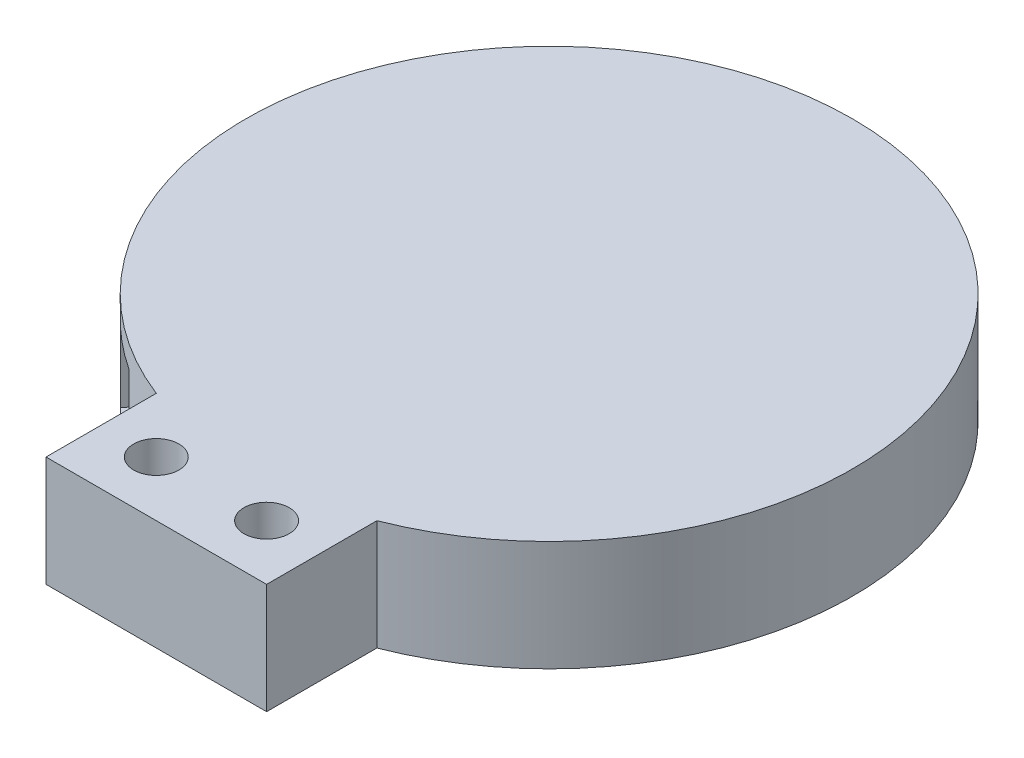
ISO-10303-21;
HEADER;
FILE_DESCRIPTION(('STEP AP214'),'2;1');
FILE_NAME('part.step','',(''),(''),'','','');
FILE_SCHEMA(('AUTOMOTIVE_DESIGN { 1 0 10303 214 1 1 1 1 }'));
ENDSEC;
DATA;
#1=APPLICATION_CONTEXT('core data for automotive mechanical design processes');
#2=APPLICATION_PROTOCOL_DEFINITION('international standard','automotive_design',2000,#1);
#3=PRODUCT_CONTEXT('',#1,'mechanical');
#4=PRODUCT('Part','Part','',(#3));
#5=PRODUCT_RELATED_PRODUCT_CATEGORY('part','',(#4));
#6=PRODUCT_DEFINITION_FORMATION('','',#4);
#7=PRODUCT_DEFINITION_CONTEXT('part definition',#1,'design');
#8=PRODUCT_DEFINITION('design','',#6,#7);
#9=PRODUCT_DEFINITION_SHAPE('','',#8);
#10=(LENGTH_UNIT() NAMED_UNIT(*) SI_UNIT(.MILLI.,.METRE.));
#11=(NAMED_UNIT(*) PLANE_ANGLE_UNIT() SI_UNIT($,.RADIAN.));
#12=(NAMED_UNIT(*) SI_UNIT($,.STERADIAN.) SOLID_ANGLE_UNIT());
#13=UNCERTAINTY_MEASURE_WITH_UNIT(LENGTH_MEASURE(1.E-05),#10,'distance_accuracy_value','');
#14=(GEOMETRIC_REPRESENTATION_CONTEXT(3) GLOBAL_UNCERTAINTY_ASSIGNED_CONTEXT((#13)) GLOBAL_UNIT_ASSIGNED_CONTEXT((#10,
#11,#12)) REPRESENTATION_CONTEXT('',''));
#15=CARTESIAN_POINT('',(0.,0.,0.));
#16=DIRECTION('',(0.,0.,1.));
#17=DIRECTION('',(1.,0.,0.));
#18=AXIS2_PLACEMENT_3D('',#15,#16,#17);
#19=CARTESIAN_POINT('',(-10.,0.,61.234753829798));
#20=DIRECTION('',(0.,1.,0.));
#21=DIRECTION('',(0.,0.,1.));
#22=AXIS2_PLACEMENT_3D('',#19,#20,#21);
#23=CYLINDRICAL_SURFACE('',#22,4.1);
#24=CARTESIAN_POINT('',(-10.,20.,61.234753829798));
#25=DIRECTION('',(0.,1.,0.));
#26=DIRECTION('',(0.,0.,1.));
#27=AXIS2_PLACEMENT_3D('',#24,#25,#26);
#28=CIRCLE('',#27,4.1);
#29=CARTESIAN_POINT('',(-10.,20.,65.334753829798));
#30=VERTEX_POINT('',#29);
#31=EDGE_CURVE('E236',#30,#30,#28,.T.);
#32=ORIENTED_EDGE('',*,*,#31,.T.);
#33=EDGE_LOOP('',(#32));
#34=FACE_BOUND('',#33,.T.);
#35=CARTESIAN_POINT('',(-10.,10.,61.234753829798));
#36=DIRECTION('',(0.,-1.,0.));
#37=DIRECTION('',(0.,0.,-1.));
#38=AXIS2_PLACEMENT_3D('',#35,#36,#37);
#39=CIRCLE('',#38,4.1);
#40=CARTESIAN_POINT('',(-10.,10.,57.134753829798));
#41=VERTEX_POINT('',#40);
#42=EDGE_CURVE('E184',#41,#41,#39,.F.);
#43=ORIENTED_EDGE('',*,*,#42,.F.);
#44=EDGE_LOOP('',(#43));
#45=FACE_BOUND('',#44,.T.);
#46=ADVANCED_FACE('F35',(#34,#45),#23,.F.);
#47=CARTESIAN_POINT('',(9.99999999999999,0.,61.234753829798));
#48=DIRECTION('',(0.,1.,0.));
#49=DIRECTION('',(0.,0.,1.));
#50=AXIS2_PLACEMENT_3D('',#47,#48,#49);
#51=CYLINDRICAL_SURFACE('',#50,4.1);
#52=CARTESIAN_POINT('',(9.99999999999999,20.,61.234753829798));
#53=DIRECTION('',(0.,1.,0.));
#54=DIRECTION('',(0.,0.,1.));
#55=AXIS2_PLACEMENT_3D('',#52,#53,#54);
#56=CIRCLE('',#55,4.1);
#57=CARTESIAN_POINT('',(9.99999999999999,20.,65.334753829798));
#58=VERTEX_POINT('',#57);
#59=EDGE_CURVE('E232',#58,#58,#56,.T.);
#60=ORIENTED_EDGE('',*,*,#59,.T.);
#61=EDGE_LOOP('',(#60));
#62=FACE_BOUND('',#61,.T.);
#63=CARTESIAN_POINT('',(9.99999999999999,10.,61.234753829798));
#64=DIRECTION('',(0.,-1.,0.));
#65=DIRECTION('',(0.,0.,-1.));
#66=AXIS2_PLACEMENT_3D('',#63,#64,#65);
#67=CIRCLE('',#66,4.1);
#68=CARTESIAN_POINT('',(9.99999999999999,10.,57.134753829798));
#69=VERTEX_POINT('',#68);
#70=EDGE_CURVE('E180',#69,#69,#67,.F.);
#71=ORIENTED_EDGE('',*,*,#70,.F.);
#72=EDGE_LOOP('',(#71));
#73=FACE_BOUND('',#72,.T.);
#74=ADVANCED_FACE('F314',(#62,#73),#51,.F.);
#75=CARTESIAN_POINT('',(0.,20.,0.));
#76=DIRECTION('',(0.,-1.,0.));
#77=DIRECTION('',(0.,0.,-1.));
#78=AXIS2_PLACEMENT_3D('',#75,#76,#77);
#79=CYLINDRICAL_SURFACE('',#78,55.);
#80=CARTESIAN_POINT('',(0.,0.999999999999997,0.));
#81=DIRECTION('',(0.,-1.,0.));
#82=DIRECTION('',(0.,0.,-1.));
#83=AXIS2_PLACEMENT_3D('',#80,#81,#82);
#84=CIRCLE('',#83,55.);
#85=CARTESIAN_POINT('',(-30.2104676008095,0.999999999999997,45.9600657891222));
#86=VERTEX_POINT('',#85);
#87=CARTESIAN_POINT('',(-40.0158364727324,0.999999999999997,37.7323843851345));
#88=VERTEX_POINT('',#87);
#89=EDGE_CURVE('E213',#86,#88,#84,.T.);
#90=ORIENTED_EDGE('',*,*,#89,.T.);
#91=DIRECTION('',(0.,-1.,0.));
#92=VECTOR('',#91,1.);
#93=CARTESIAN_POINT('',(-40.0158364727324,20.,37.7323843851345));
#94=LINE('',#93,#92);
#95=CARTESIAN_POINT('',(-40.0158364727324,16.,37.7323843851345));
#96=VERTEX_POINT('',#95);
#97=EDGE_CURVE('E216',#88,#96,#94,.F.);
#98=ORIENTED_EDGE('',*,*,#97,.T.);
#99=CARTESIAN_POINT('',(0.,16.,0.));
#100=DIRECTION('',(0.,1.,0.));
#101=DIRECTION('',(0.,0.,1.));
#102=AXIS2_PLACEMENT_3D('',#99,#100,#101);
#103=CIRCLE('',#102,55.);
#104=CARTESIAN_POINT('',(-30.2104676008095,16.,45.9600657891222));
#105=VERTEX_POINT('',#104);
#106=EDGE_CURVE('E201',#96,#105,#103,.T.);
#107=ORIENTED_EDGE('',*,*,#106,.T.);
#108=DIRECTION('',(0.,-1.,0.));
#109=VECTOR('',#108,1.);
#110=CARTESIAN_POINT('',(-30.2104676008095,20.,45.9600657891222));
#111=LINE('',#110,#109);
#112=EDGE_CURVE('E210',#105,#86,#111,.T.);
#113=ORIENTED_EDGE('',*,*,#112,.T.);
#114=EDGE_LOOP('',(#90,#98,#107,#113));
#115=FACE_BOUND('',#114,.T.);
#116=CARTESIAN_POINT('',(0.,0.,0.));
#117=DIRECTION('',(0.,1.,0.));
#118=DIRECTION('',(0.,0.,1.));
#119=AXIS2_PLACEMENT_3D('',#116,#117,#118);
#120=CIRCLE('',#119,55.);
#121=CARTESIAN_POINT('',(20.,0.,51.234753829798));
#122=VERTEX_POINT('',#121);
#123=CARTESIAN_POINT('',(-20.,0.,51.234753829798));
#124=VERTEX_POINT('',#123);
#125=EDGE_CURVE('E266',#122,#124,#120,.T.);
#126=ORIENTED_EDGE('',*,*,#125,.T.);
#127=DIRECTION('',(0.,-1.,0.));
#128=VECTOR('',#127,1.);
#129=CARTESIAN_POINT('',(-20.,64.7213595499958,51.234753829798));
#130=LINE('',#129,#128);
#131=CARTESIAN_POINT('',(-20.,20.,51.234753829798));
#132=VERTEX_POINT('',#131);
#133=EDGE_CURVE('E259',#132,#124,#130,.T.);
#134=ORIENTED_EDGE('',*,*,#133,.F.);
#135=CARTESIAN_POINT('',(0.,20.,0.));
#136=DIRECTION('',(0.,1.,0.));
#137=DIRECTION('',(0.,0.,1.));
#138=AXIS2_PLACEMENT_3D('',#135,#136,#137);
#139=CIRCLE('',#138,55.);
#140=CARTESIAN_POINT('',(20.,20.,51.234753829798));
#141=VERTEX_POINT('',#140);
#142=EDGE_CURVE('E267',#141,#132,#139,.T.);
#143=ORIENTED_EDGE('',*,*,#142,.F.);
#144=DIRECTION('',(0.,-1.,0.));
#145=VECTOR('',#144,1.);
#146=CARTESIAN_POINT('',(20.,64.7213595499958,51.234753829798));
#147=LINE('',#146,#145);
#148=EDGE_CURVE('E256',#141,#122,#147,.T.);
#149=ORIENTED_EDGE('',*,*,#148,.T.);
#150=EDGE_LOOP('',(#126,#134,#143,#149));
#151=FACE_BOUND('',#150,.T.);
#152=ADVANCED_FACE('F320',(#115,#151),#79,.T.);
#153=CARTESIAN_POINT('',(0.,20.,0.));
#154=DIRECTION('',(0.,1.,0.));
#155=DIRECTION('',(0.,0.,1.));
#156=AXIS2_PLACEMENT_3D('',#153,#154,#155);
#157=PLANE('',#156);
#158=ORIENTED_EDGE('',*,*,#59,.F.);
#159=EDGE_LOOP('',(#158));
#160=FACE_BOUND('',#159,.T.);
#161=ORIENTED_EDGE('',*,*,#31,.F.);
#162=EDGE_LOOP('',(#161));
#163=FACE_BOUND('',#162,.T.);
#164=ORIENTED_EDGE('',*,*,#142,.T.);
#165=DIRECTION('',(0.,0.,-1.));
#166=VECTOR('',#165,1.);
#167=CARTESIAN_POINT('',(-20.,20.,51.234753829798));
#168=LINE('',#167,#166);
#169=CARTESIAN_POINT('',(-20.,20.,71.234753829798));
#170=VERTEX_POINT('',#169);
#171=EDGE_CURVE('E257',#170,#132,#168,.T.);
#172=ORIENTED_EDGE('',*,*,#171,.F.);
#173=DIRECTION('',(-1.,0.,0.));
#174=VECTOR('',#173,1.);
#175=CARTESIAN_POINT('',(-20.,20.,71.234753829798));
#176=LINE('',#175,#174);
#177=CARTESIAN_POINT('',(20.,20.,71.234753829798));
#178=VERTEX_POINT('',#177);
#179=EDGE_CURVE('E243',#178,#170,#176,.T.);
#180=ORIENTED_EDGE('',*,*,#179,.F.);
#181=DIRECTION('',(0.,0.,1.));
#182=VECTOR('',#181,1.);
#183=CARTESIAN_POINT('',(20.,20.,51.234753829798));
#184=LINE('',#183,#182);
#185=EDGE_CURVE('E252',#141,#178,#184,.T.);
#186=ORIENTED_EDGE('',*,*,#185,.F.);
#187=EDGE_LOOP('',(#164,#172,#180,#186));
#188=FACE_BOUND('',#187,.T.);
#189=ADVANCED_FACE('F340',(#160,#163,#188),#157,.T.);
#190=CARTESIAN_POINT('',(0.,0.,0.));
#191=DIRECTION('',(0.,1.,0.));
#192=DIRECTION('',(0.,0.,1.));
#193=AXIS2_PLACEMENT_3D('',#190,#191,#192);
#194=PLANE('',#193);
#195=DIRECTION('',(1.,0.,0.));
#196=VECTOR('',#195,1.);
#197=CARTESIAN_POINT('',(0.,0.,69.734753829798));
#198=LINE('',#197,#196);
#199=CARTESIAN_POINT('',(-18.5,0.,69.734753829798));
#200=VERTEX_POINT('',#199);
#201=CARTESIAN_POINT('',(18.5,0.,69.734753829798));
#202=VERTEX_POINT('',#201);
#203=EDGE_CURVE('E278',#200,#202,#198,.T.);
#204=ORIENTED_EDGE('',*,*,#203,.T.);
#205=DIRECTION('',(0.,0.,-1.));
#206=VECTOR('',#205,1.);
#207=CARTESIAN_POINT('',(18.5,0.,0.));
#208=LINE('',#207,#206);
#209=CARTESIAN_POINT('',(18.5,0.,52.734753829798));
#210=VERTEX_POINT('',#209);
#211=EDGE_CURVE('E280',#202,#210,#208,.T.);
#212=ORIENTED_EDGE('',*,*,#211,.T.);
#213=DIRECTION('',(-1.,0.,0.));
#214=VECTOR('',#213,1.);
#215=CARTESIAN_POINT('',(0.,0.,52.734753829798));
#216=LINE('',#215,#214);
#217=CARTESIAN_POINT('',(-18.5,0.,52.734753829798));
#218=VERTEX_POINT('',#217);
#219=EDGE_CURVE('E274',#210,#218,#216,.T.);
#220=ORIENTED_EDGE('',*,*,#219,.T.);
#221=DIRECTION('',(0.,0.,1.));
#222=VECTOR('',#221,1.);
#223=CARTESIAN_POINT('',(-18.5,0.,0.));
#224=LINE('',#223,#222);
#225=EDGE_CURVE('E276',#218,#200,#224,.T.);
#226=ORIENTED_EDGE('',*,*,#225,.T.);
#227=EDGE_LOOP('',(#204,#212,#220,#226));
#228=FACE_BOUND('',#227,.T.);
#229=DIRECTION('',(0.766044443118977,0.,0.642787609686541));
#230=VECTOR('',#229,1.);
#231=CARTESIAN_POINT('',(-27.3294558232921,0.,44.2391325005671));
#232=LINE('',#231,#230);
#233=CARTESIAN_POINT('',(-38.8213304727493,0.,34.5963047206719));
#234=VERTEX_POINT('',#233);
#235=CARTESIAN_POINT('',(-27.3294558232922,0.,44.239132500567));
#236=VERTEX_POINT('',#235);
#237=EDGE_CURVE('E219',#234,#236,#232,.T.);
#238=ORIENTED_EDGE('',*,*,#237,.T.);
#239=CARTESIAN_POINT('',(0.,0.,0.));
#240=DIRECTION('',(0.,-1.,0.));
#241=DIRECTION('',(0.,0.,-1.));
#242=AXIS2_PLACEMENT_3D('',#239,#240,#241);
#243=CIRCLE('',#242,52.);
#244=EDGE_CURVE('E222',#234,#236,#243,.T.);
#245=ORIENTED_EDGE('',*,*,#244,.F.);
#246=EDGE_LOOP('',(#238,#245));
#247=FACE_BOUND('',#246,.T.);
#248=DIRECTION('',(0.,0.,-1.));
#249=VECTOR('',#248,1.);
#250=CARTESIAN_POINT('',(-20.,0.,51.234753829798));
#251=LINE('',#250,#249);
#252=CARTESIAN_POINT('',(-20.,0.,71.234753829798));
#253=VERTEX_POINT('',#252);
#254=EDGE_CURVE('E240',#253,#124,#251,.T.);
#255=ORIENTED_EDGE('',*,*,#254,.T.);
#256=ORIENTED_EDGE('',*,*,#125,.F.);
#257=DIRECTION('',(0.,0.,1.));
#258=VECTOR('',#257,1.);
#259=CARTESIAN_POINT('',(20.,0.,51.234753829798));
#260=LINE('',#259,#258);
#261=CARTESIAN_POINT('',(20.,0.,71.234753829798));
#262=VERTEX_POINT('',#261);
#263=EDGE_CURVE('E239',#122,#262,#260,.T.);
#264=ORIENTED_EDGE('',*,*,#263,.T.);
#265=DIRECTION('',(-1.,0.,0.));
#266=VECTOR('',#265,1.);
#267=CARTESIAN_POINT('',(-20.,0.,71.234753829798));
#268=LINE('',#267,#266);
#269=EDGE_CURVE('E244',#262,#253,#268,.T.);
#270=ORIENTED_EDGE('',*,*,#269,.T.);
#271=EDGE_LOOP('',(#255,#256,#264,#270));
#272=FACE_BOUND('',#271,.T.);
#273=ADVANCED_FACE('F338',(#228,#247,#272),#194,.F.);
#274=CARTESIAN_POINT('',(-20.,64.7213595499958,71.234753829798));
#275=DIRECTION('',(0.,0.,1.));
#276=DIRECTION('',(1.,0.,0.));
#277=AXIS2_PLACEMENT_3D('',#274,#275,#276);
#278=PLANE('',#277);
#279=DIRECTION('',(0.,-1.,0.));
#280=VECTOR('',#279,1.);
#281=CARTESIAN_POINT('',(20.,64.7213595499958,71.234753829798));
#282=LINE('',#281,#280);
#283=EDGE_CURVE('E255',#178,#262,#282,.T.);
#284=ORIENTED_EDGE('',*,*,#283,.F.);
#285=ORIENTED_EDGE('',*,*,#179,.T.);
#286=DIRECTION('',(0.,-1.,0.));
#287=VECTOR('',#286,1.);
#288=CARTESIAN_POINT('',(-20.,64.7213595499958,71.234753829798));
#289=LINE('',#288,#287);
#290=EDGE_CURVE('E251',#170,#253,#289,.T.);
#291=ORIENTED_EDGE('',*,*,#290,.T.);
#292=ORIENTED_EDGE('',*,*,#269,.F.);
#293=EDGE_LOOP('',(#284,#285,#291,#292));
#294=FACE_BOUND('',#293,.T.);
#295=ADVANCED_FACE('F334',(#294),#278,.T.);
#296=CARTESIAN_POINT('',(-20.,64.7213595499958,51.234753829798));
#297=DIRECTION('',(-1.,0.,0.));
#298=DIRECTION('',(0.,0.,1.));
#299=AXIS2_PLACEMENT_3D('',#296,#297,#298);
#300=PLANE('',#299);
#301=ORIENTED_EDGE('',*,*,#290,.F.);
#302=ORIENTED_EDGE('',*,*,#171,.T.);
#303=ORIENTED_EDGE('',*,*,#133,.T.);
#304=ORIENTED_EDGE('',*,*,#254,.F.);
#305=EDGE_LOOP('',(#301,#302,#303,#304));
#306=FACE_BOUND('',#305,.T.);
#307=ADVANCED_FACE('F330',(#306),#300,.T.);
#308=CARTESIAN_POINT('',(20.,64.7213595499958,51.234753829798));
#309=DIRECTION('',(1.,0.,0.));
#310=DIRECTION('',(0.,0.,-1.));
#311=AXIS2_PLACEMENT_3D('',#308,#309,#310);
#312=PLANE('',#311);
#313=ORIENTED_EDGE('',*,*,#148,.F.);
#314=ORIENTED_EDGE('',*,*,#185,.T.);
#315=ORIENTED_EDGE('',*,*,#283,.T.);
#316=ORIENTED_EDGE('',*,*,#263,.F.);
#317=EDGE_LOOP('',(#313,#314,#315,#316));
#318=FACE_BOUND('',#317,.T.);
#319=ADVANCED_FACE('F326',(#318),#312,.T.);
#320=CARTESIAN_POINT('',(0.,17.,0.));
#321=DIRECTION('',(0.,-1.,0.));
#322=DIRECTION('',(0.,0.,-1.));
#323=AXIS2_PLACEMENT_3D('',#320,#321,#322);
#324=CYLINDRICAL_SURFACE('',#323,52.);
#325=ORIENTED_EDGE('',*,*,#244,.T.);
#326=DIRECTION('',(0.,-1.,0.));
#327=VECTOR('',#326,1.);
#328=CARTESIAN_POINT('',(-27.3294558232921,32.0015769354944,44.2391325005671));
#329=LINE('',#328,#327);
#330=CARTESIAN_POINT('',(-27.3294558232921,17.,44.2391325005671));
#331=VERTEX_POINT('',#330);
#332=EDGE_CURVE('E223',#331,#236,#329,.T.);
#333=ORIENTED_EDGE('',*,*,#332,.F.);
#334=CARTESIAN_POINT('',(0.,17.,0.));
#335=DIRECTION('',(0.,-1.,0.));
#336=DIRECTION('',(0.,0.,-1.));
#337=AXIS2_PLACEMENT_3D('',#334,#335,#336);
#338=CIRCLE('',#337,52.);
#339=CARTESIAN_POINT('',(-38.8213304727494,17.,34.5963047206718));
#340=VERTEX_POINT('',#339);
#341=EDGE_CURVE('E230',#340,#331,#338,.T.);
#342=ORIENTED_EDGE('',*,*,#341,.F.);
#343=DIRECTION('',(0.,-1.,0.));
#344=VECTOR('',#343,1.);
#345=CARTESIAN_POINT('',(-38.8213304727494,32.0015769354944,34.5963047206719));
#346=LINE('',#345,#344);
#347=EDGE_CURVE('E226',#340,#234,#346,.T.);
#348=ORIENTED_EDGE('',*,*,#347,.T.);
#349=EDGE_LOOP('',(#325,#333,#342,#348));
#350=FACE_BOUND('',#349,.T.);
#351=ADVANCED_FACE('F329',(#350),#324,.F.);
#352=CARTESIAN_POINT('',(0.,17.,0.));
#353=DIRECTION('',(0.,-1.,0.));
#354=DIRECTION('',(0.,0.,-1.));
#355=AXIS2_PLACEMENT_3D('',#352,#353,#354);
#356=PLANE('',#355);
#357=DIRECTION('',(-0.766044443118977,0.,-0.642787609686541));
#358=VECTOR('',#357,1.);
#359=CARTESIAN_POINT('',(-27.3294558232921,17.,44.2391325005671));
#360=LINE('',#359,#358);
#361=EDGE_CURVE('E220',#331,#340,#360,.T.);
#362=ORIENTED_EDGE('',*,*,#361,.T.);
#363=ORIENTED_EDGE('',*,*,#341,.T.);
#364=EDGE_LOOP('',(#362,#363));
#365=FACE_BOUND('',#364,.T.);
#366=ADVANCED_FACE('F459',(#365),#356,.T.);
#367=CARTESIAN_POINT('',(-27.3294558232921,32.0015769354944,44.2391325005671));
#368=DIRECTION('',(0.642787609686541,0.,-0.766044443118977));
#369=DIRECTION('',(-0.766044443118977,0.,-0.642787609686541));
#370=AXIS2_PLACEMENT_3D('',#367,#368,#369);
#371=PLANE('',#370);
#372=DIRECTION('',(0.,1.,0.));
#373=VECTOR('',#372,1.);
#374=CARTESIAN_POINT('',(-37.9780775839822,0.999999999999997,35.3038779086256));
#375=LINE('',#374,#373);
#376=CARTESIAN_POINT('',(-37.9780775839822,0.999999999999997,35.3038779086256));
#377=VERTEX_POINT('',#376);
#378=CARTESIAN_POINT('',(-37.9780775839822,16.,35.3038779086256));
#379=VERTEX_POINT('',#378);
#380=EDGE_CURVE('E187',#377,#379,#375,.T.);
#381=ORIENTED_EDGE('',*,*,#380,.F.);
#382=DIRECTION('',(-0.766044443118976,0.,-0.642787609686541));
#383=VECTOR('',#382,1.);
#384=CARTESIAN_POINT('',(-28.1727087120593,0.999999999999997,43.5315593126133));
#385=LINE('',#384,#383);
#386=CARTESIAN_POINT('',(-28.1727087120593,0.999999999999997,43.5315593126133));
#387=VERTEX_POINT('',#386);
#388=EDGE_CURVE('E195',#387,#377,#385,.T.);
#389=ORIENTED_EDGE('',*,*,#388,.F.);
#390=DIRECTION('',(0.,-1.,0.));
#391=VECTOR('',#390,1.);
#392=CARTESIAN_POINT('',(-28.1727087120593,0.999999999999997,43.5315593126133));
#393=LINE('',#392,#391);
#394=CARTESIAN_POINT('',(-28.1727087120593,16.,43.5315593126133));
#395=VERTEX_POINT('',#394);
#396=EDGE_CURVE('E192',#395,#387,#393,.T.);
#397=ORIENTED_EDGE('',*,*,#396,.F.);
#398=DIRECTION('',(0.766044443118976,0.,0.642787609686541));
#399=VECTOR('',#398,1.);
#400=CARTESIAN_POINT('',(-28.1727087120593,16.,43.5315593126133));
#401=LINE('',#400,#399);
#402=EDGE_CURVE('E189',#379,#395,#401,.T.);
#403=ORIENTED_EDGE('',*,*,#402,.F.);
#404=EDGE_LOOP('',(#381,#389,#397,#403));
#405=FACE_BOUND('',#404,.T.);
#406=ORIENTED_EDGE('',*,*,#361,.F.);
#407=ORIENTED_EDGE('',*,*,#332,.T.);
#408=ORIENTED_EDGE('',*,*,#237,.F.);
#409=ORIENTED_EDGE('',*,*,#347,.F.);
#410=EDGE_LOOP('',(#406,#407,#408,#409));
#411=FACE_BOUND('',#410,.T.);
#412=ADVANCED_FACE('F450',(#405,#411),#371,.T.);
#413=CARTESIAN_POINT('',(-62.7036284778716,0.999999999999997,64.7706420152891));
#414=DIRECTION('',(-0.766044443118977,0.,-0.642787609686541));
#415=DIRECTION('',(-0.642787609686541,0.,0.766044443118977));
#416=AXIS2_PLACEMENT_3D('',#413,#414,#415);
#417=PLANE('',#416);
#418=DIRECTION('',(0.642787609686541,0.,-0.766044443118977));
#419=VECTOR('',#418,1.);
#420=CARTESIAN_POINT('',(-62.7036284778716,0.999999999999997,64.7706420152891));
#421=LINE('',#420,#419);
#422=EDGE_CURVE('E199',#88,#377,#421,.T.);
#423=ORIENTED_EDGE('',*,*,#422,.T.);
#424=ORIENTED_EDGE('',*,*,#380,.T.);
#425=DIRECTION('',(0.642787609686541,0.,-0.766044443118977));
#426=VECTOR('',#425,1.);
#427=CARTESIAN_POINT('',(-62.7036284778716,16.,64.7706420152891));
#428=LINE('',#427,#426);
#429=EDGE_CURVE('E198',#96,#379,#428,.T.);
#430=ORIENTED_EDGE('',*,*,#429,.F.);
#431=ORIENTED_EDGE('',*,*,#97,.F.);
#432=EDGE_LOOP('',(#423,#424,#430,#431));
#433=FACE_BOUND('',#432,.T.);
#434=ADVANCED_FACE('F440',(#433),#417,.F.);
#435=CARTESIAN_POINT('',(-52.8982596059487,0.999999999999997,72.9983234192769));
#436=DIRECTION('',(0.,-1.,0.));
#437=DIRECTION('',(0.,0.,-1.));
#438=AXIS2_PLACEMENT_3D('',#435,#436,#437);
#439=PLANE('',#438);
#440=DIRECTION('',(0.642787609686541,0.,-0.766044443118977));
#441=VECTOR('',#440,1.);
#442=CARTESIAN_POINT('',(-52.8982596059487,0.999999999999997,72.9983234192769));
#443=LINE('',#442,#441);
#444=EDGE_CURVE('E202',#86,#387,#443,.T.);
#445=ORIENTED_EDGE('',*,*,#444,.T.);
#446=ORIENTED_EDGE('',*,*,#388,.T.);
#447=ORIENTED_EDGE('',*,*,#422,.F.);
#448=ORIENTED_EDGE('',*,*,#89,.F.);
#449=EDGE_LOOP('',(#445,#446,#447,#448));
#450=FACE_BOUND('',#449,.T.);
#451=ADVANCED_FACE('F430',(#450),#439,.F.);
#452=CARTESIAN_POINT('',(-52.8982596059487,0.999999999999997,72.9983234192769));
#453=DIRECTION('',(0.766044443118977,0.,0.642787609686541));
#454=DIRECTION('',(0.642787609686541,0.,-0.766044443118977));
#455=AXIS2_PLACEMENT_3D('',#452,#453,#454);
#456=PLANE('',#455);
#457=DIRECTION('',(0.642787609686541,0.,-0.766044443118977));
#458=VECTOR('',#457,1.);
#459=CARTESIAN_POINT('',(-52.8982596059487,16.,72.9983234192769));
#460=LINE('',#459,#458);
#461=EDGE_CURVE('E204',#105,#395,#460,.T.);
#462=ORIENTED_EDGE('',*,*,#461,.T.);
#463=ORIENTED_EDGE('',*,*,#396,.T.);
#464=ORIENTED_EDGE('',*,*,#444,.F.);
#465=ORIENTED_EDGE('',*,*,#112,.F.);
#466=EDGE_LOOP('',(#462,#463,#464,#465));
#467=FACE_BOUND('',#466,.T.);
#468=ADVANCED_FACE('F420',(#467),#456,.F.);
#469=CARTESIAN_POINT('',(-52.8982596059487,16.,72.9983234192769));
#470=DIRECTION('',(0.,1.,0.));
#471=DIRECTION('',(0.,0.,1.));
#472=AXIS2_PLACEMENT_3D('',#469,#470,#471);
#473=PLANE('',#472);
#474=ORIENTED_EDGE('',*,*,#429,.T.);
#475=ORIENTED_EDGE('',*,*,#402,.T.);
#476=ORIENTED_EDGE('',*,*,#461,.F.);
#477=ORIENTED_EDGE('',*,*,#106,.F.);
#478=EDGE_LOOP('',(#474,#475,#476,#477));
#479=FACE_BOUND('',#478,.T.);
#480=ADVANCED_FACE('F401',(#479),#473,.F.);
#481=CARTESIAN_POINT('',(0.,10.,0.));
#482=DIRECTION('',(0.,-1.,0.));
#483=DIRECTION('',(0.,0.,-1.));
#484=AXIS2_PLACEMENT_3D('',#481,#482,#483);
#485=PLANE('',#484);
#486=DIRECTION('',(0.,0.,1.));
#487=VECTOR('',#486,1.);
#488=CARTESIAN_POINT('',(17.5,10.,68.734753829798));
#489=LINE('',#488,#487);
#490=CARTESIAN_POINT('',(17.5,10.,53.734753829798));
#491=VERTEX_POINT('',#490);
#492=CARTESIAN_POINT('',(17.5,10.,68.734753829798));
#493=VERTEX_POINT('',#492);
#494=EDGE_CURVE('E154',#491,#493,#489,.T.);
#495=ORIENTED_EDGE('',*,*,#494,.T.);
#496=DIRECTION('',(-1.,0.,0.));
#497=VECTOR('',#496,1.);
#498=CARTESIAN_POINT('',(-17.5,10.,68.734753829798));
#499=LINE('',#498,#497);
#500=CARTESIAN_POINT('',(-17.5,10.,68.734753829798));
#501=VERTEX_POINT('',#500);
#502=EDGE_CURVE('E162',#493,#501,#499,.T.);
#503=ORIENTED_EDGE('',*,*,#502,.T.);
#504=DIRECTION('',(0.,0.,-1.));
#505=VECTOR('',#504,1.);
#506=CARTESIAN_POINT('',(-17.5,10.,68.734753829798));
#507=LINE('',#506,#505);
#508=CARTESIAN_POINT('',(-17.5,10.,53.734753829798));
#509=VERTEX_POINT('',#508);
#510=EDGE_CURVE('E167',#501,#509,#507,.T.);
#511=ORIENTED_EDGE('',*,*,#510,.T.);
#512=DIRECTION('',(1.,0.,0.));
#513=VECTOR('',#512,1.);
#514=CARTESIAN_POINT('',(-17.5,10.,53.734753829798));
#515=LINE('',#514,#513);
#516=EDGE_CURVE('E159',#509,#491,#515,.T.);
#517=ORIENTED_EDGE('',*,*,#516,.T.);
#518=EDGE_LOOP('',(#495,#503,#511,#517));
#519=FACE_BOUND('',#518,.T.);
#520=ORIENTED_EDGE('',*,*,#70,.T.);
#521=EDGE_LOOP('',(#520));
#522=FACE_BOUND('',#521,.T.);
#523=ORIENTED_EDGE('',*,*,#42,.T.);
#524=EDGE_LOOP('',(#523));
#525=FACE_BOUND('',#524,.T.);
#526=ADVANCED_FACE('F169',(#519,#522,#525),#485,.T.);
#527=CARTESIAN_POINT('',(17.5,10.,68.734753829798));
#528=DIRECTION('',(1.,0.,0.));
#529=DIRECTION('',(0.,0.,-1.));
#530=AXIS2_PLACEMENT_3D('',#527,#528,#529);
#531=PLANE('',#530);
#532=DIRECTION('',(0.,-1.,0.));
#533=VECTOR('',#532,1.);
#534=CARTESIAN_POINT('',(17.5,10.,53.734753829798));
#535=LINE('',#534,#533);
#536=CARTESIAN_POINT('',(17.5,2.74747741945461,53.734753829798));
#537=VERTEX_POINT('',#536);
#538=EDGE_CURVE('E178',#491,#537,#535,.T.);
#539=ORIENTED_EDGE('',*,*,#538,.T.);
#540=DIRECTION('',(0.,0.,1.));
#541=VECTOR('',#540,1.);
#542=CARTESIAN_POINT('',(17.5,2.74747741945461,68.734753829798));
#543=LINE('',#542,#541);
#544=CARTESIAN_POINT('',(17.5,2.74747741945461,68.734753829798));
#545=VERTEX_POINT('',#544);
#546=EDGE_CURVE('E157',#537,#545,#543,.T.);
#547=ORIENTED_EDGE('',*,*,#546,.T.);
#548=DIRECTION('',(0.,-1.,0.));
#549=VECTOR('',#548,1.);
#550=CARTESIAN_POINT('',(17.5,10.,68.734753829798));
#551=LINE('',#550,#549);
#552=EDGE_CURVE('E149',#493,#545,#551,.T.);
#553=ORIENTED_EDGE('',*,*,#552,.F.);
#554=ORIENTED_EDGE('',*,*,#494,.F.);
#555=EDGE_LOOP('',(#539,#547,#553,#554));
#556=FACE_BOUND('',#555,.T.);
#557=ADVANCED_FACE('F152',(#556),#531,.F.);
#558=CARTESIAN_POINT('',(-17.5,10.,53.734753829798));
#559=DIRECTION('',(0.,0.,-1.));
#560=DIRECTION('',(-1.,0.,0.));
#561=AXIS2_PLACEMENT_3D('',#558,#559,#560);
#562=PLANE('',#561);
#563=DIRECTION('',(0.,-1.,0.));
#564=VECTOR('',#563,1.);
#565=CARTESIAN_POINT('',(-17.5,10.,53.734753829798));
#566=LINE('',#565,#564);
#567=CARTESIAN_POINT('',(-17.5,2.74747741945461,53.734753829798));
#568=VERTEX_POINT('',#567);
#569=EDGE_CURVE('E181',#509,#568,#566,.T.);
#570=ORIENTED_EDGE('',*,*,#569,.T.);
#571=DIRECTION('',(1.,0.,0.));
#572=VECTOR('',#571,1.);
#573=CARTESIAN_POINT('',(-17.5,2.74747741945461,53.734753829798));
#574=LINE('',#573,#572);
#575=EDGE_CURVE('E11',#568,#537,#574,.T.);
#576=ORIENTED_EDGE('',*,*,#575,.T.);
#577=ORIENTED_EDGE('',*,*,#538,.F.);
#578=ORIENTED_EDGE('',*,*,#516,.F.);
#579=EDGE_LOOP('',(#570,#576,#577,#578));
#580=FACE_BOUND('',#579,.T.);
#581=ADVANCED_FACE('F303',(#580),#562,.F.);
#582=CARTESIAN_POINT('',(-17.5,10.,68.734753829798));
#583=DIRECTION('',(-1.,0.,0.));
#584=DIRECTION('',(0.,0.,1.));
#585=AXIS2_PLACEMENT_3D('',#582,#583,#584);
#586=PLANE('',#585);
#587=DIRECTION('',(0.,-1.,0.));
#588=VECTOR('',#587,1.);
#589=CARTESIAN_POINT('',(-17.5,10.,68.734753829798));
#590=LINE('',#589,#588);
#591=CARTESIAN_POINT('',(-17.5,2.74747741945461,68.734753829798));
#592=VERTEX_POINT('',#591);
#593=EDGE_CURVE('E158',#501,#592,#590,.T.);
#594=ORIENTED_EDGE('',*,*,#593,.T.);
#595=DIRECTION('',(0.,0.,-1.));
#596=VECTOR('',#595,1.);
#597=CARTESIAN_POINT('',(-17.5,2.74747741945461,68.734753829798));
#598=LINE('',#597,#596);
#599=EDGE_CURVE('E44',#592,#568,#598,.T.);
#600=ORIENTED_EDGE('',*,*,#599,.T.);
#601=ORIENTED_EDGE('',*,*,#569,.F.);
#602=ORIENTED_EDGE('',*,*,#510,.F.);
#603=EDGE_LOOP('',(#594,#600,#601,#602));
#604=FACE_BOUND('',#603,.T.);
#605=ADVANCED_FACE('F304',(#604),#586,.F.);
#606=CARTESIAN_POINT('',(-17.5,10.,68.734753829798));
#607=DIRECTION('',(0.,0.,1.));
#608=DIRECTION('',(1.,0.,0.));
#609=AXIS2_PLACEMENT_3D('',#606,#607,#608);
#610=PLANE('',#609);
#611=ORIENTED_EDGE('',*,*,#552,.T.);
#612=DIRECTION('',(-1.,0.,0.));
#613=VECTOR('',#612,1.);
#614=CARTESIAN_POINT('',(-17.5,2.74747741945461,68.734753829798));
#615=LINE('',#614,#613);
#616=EDGE_CURVE('E59',#545,#592,#615,.T.);
#617=ORIENTED_EDGE('',*,*,#616,.T.);
#618=ORIENTED_EDGE('',*,*,#593,.F.);
#619=ORIENTED_EDGE('',*,*,#502,.F.);
#620=EDGE_LOOP('',(#611,#617,#618,#619));
#621=FACE_BOUND('',#620,.T.);
#622=ADVANCED_FACE('F163',(#621),#610,.F.);
#623=CARTESIAN_POINT('',(-17.5,2.74747741945461,68.734753829798));
#624=DIRECTION('',(-0.939692620785908,0.34202014332567,0.));
#625=DIRECTION('',(0.,0.,-1.));
#626=AXIS2_PLACEMENT_3D('',#623,#624,#625);
#627=PLANE('',#626);
#628=DIRECTION('',(-0.323615577118186,-0.889126490715987,0.323615577118186));
#629=VECTOR('',#628,1.);
#630=CARTESIAN_POINT('',(-17.5,2.74747741945461,68.734753829798));
#631=LINE('',#630,#629);
#632=EDGE_CURVE('E174',#200,#592,#631,.F.);
#633=ORIENTED_EDGE('',*,*,#632,.F.);
#634=ORIENTED_EDGE('',*,*,#225,.F.);
#635=DIRECTION('',(-0.323615577118186,-0.889126490715987,-0.323615577118186));
#636=VECTOR('',#635,1.);
#637=CARTESIAN_POINT('',(-15.929094373697,7.06350515581643,55.3056594561011));
#638=LINE('',#637,#636);
#639=EDGE_CURVE('E39',#568,#218,#638,.T.);
#640=ORIENTED_EDGE('',*,*,#639,.F.);
#641=ORIENTED_EDGE('',*,*,#599,.F.);
#642=EDGE_LOOP('',(#633,#634,#640,#641));
#643=FACE_BOUND('',#642,.T.);
#644=ADVANCED_FACE('F37',(#643),#627,.F.);
#645=CARTESIAN_POINT('',(-17.5,2.74747741945461,53.734753829798));
#646=DIRECTION('',(0.,0.342020143325671,-0.939692620785908));
#647=DIRECTION('',(1.,0.,0.));
#648=AXIS2_PLACEMENT_3D('',#645,#646,#647);
#649=PLANE('',#648);
#650=ORIENTED_EDGE('',*,*,#639,.T.);
#651=ORIENTED_EDGE('',*,*,#219,.F.);
#652=DIRECTION('',(-0.323615577118187,0.889126490715987,0.323615577118186));
#653=VECTOR('',#652,1.);
#654=CARTESIAN_POINT('',(15.9290943736969,7.06350515581643,55.3056594561011));
#655=LINE('',#654,#653);
#656=EDGE_CURVE('E287',#537,#210,#655,.F.);
#657=ORIENTED_EDGE('',*,*,#656,.F.);
#658=ORIENTED_EDGE('',*,*,#575,.F.);
#659=EDGE_LOOP('',(#650,#651,#657,#658));
#660=FACE_BOUND('',#659,.T.);
#661=ADVANCED_FACE('F301',(#660),#649,.F.);
#662=CARTESIAN_POINT('',(-17.5,2.74747741945461,68.734753829798));
#663=DIRECTION('',(0.,0.342020143325671,0.939692620785908));
#664=DIRECTION('',(-1.,0.,0.));
#665=AXIS2_PLACEMENT_3D('',#662,#663,#664);
#666=PLANE('',#665);
#667=ORIENTED_EDGE('',*,*,#632,.T.);
#668=ORIENTED_EDGE('',*,*,#616,.F.);
#669=DIRECTION('',(0.323615577118187,-0.889126490715987,0.323615577118186));
#670=VECTOR('',#669,1.);
#671=CARTESIAN_POINT('',(17.5,2.74747741945461,68.734753829798));
#672=LINE('',#671,#670);
#673=EDGE_CURVE('E285',#202,#545,#672,.F.);
#674=ORIENTED_EDGE('',*,*,#673,.F.);
#675=ORIENTED_EDGE('',*,*,#203,.F.);
#676=EDGE_LOOP('',(#667,#668,#674,#675));
#677=FACE_BOUND('',#676,.T.);
#678=ADVANCED_FACE('F292',(#677),#666,.F.);
#679=CARTESIAN_POINT('',(17.5,2.74747741945461,68.734753829798));
#680=DIRECTION('',(0.939692620785908,0.342020143325671,0.));
#681=DIRECTION('',(0.,0.,1.));
#682=AXIS2_PLACEMENT_3D('',#679,#680,#681);
#683=PLANE('',#682);
#684=ORIENTED_EDGE('',*,*,#656,.T.);
#685=ORIENTED_EDGE('',*,*,#211,.F.);
#686=ORIENTED_EDGE('',*,*,#673,.T.);
#687=ORIENTED_EDGE('',*,*,#546,.F.);
#688=EDGE_LOOP('',(#684,#685,#686,#687));
#689=FACE_BOUND('',#688,.T.);
#690=ADVANCED_FACE('F350',(#689),#683,.F.);
#691=CLOSED_SHELL('',(#46,#74,#152,#189,#273,#295,#307,#319,#351,#366,#412,#434,#451,#468,#480,
#526,#557,#581,#605,#622,#644,#661,#678,#690));
#692=MANIFOLD_SOLID_BREP('B2',#691);
#693=ADVANCED_BREP_SHAPE_REPRESENTATION('',(#18,#692),#14);
#694=SHAPE_DEFINITION_REPRESENTATION(#9,#693);
ENDSEC;
END-ISO-10303-21;
